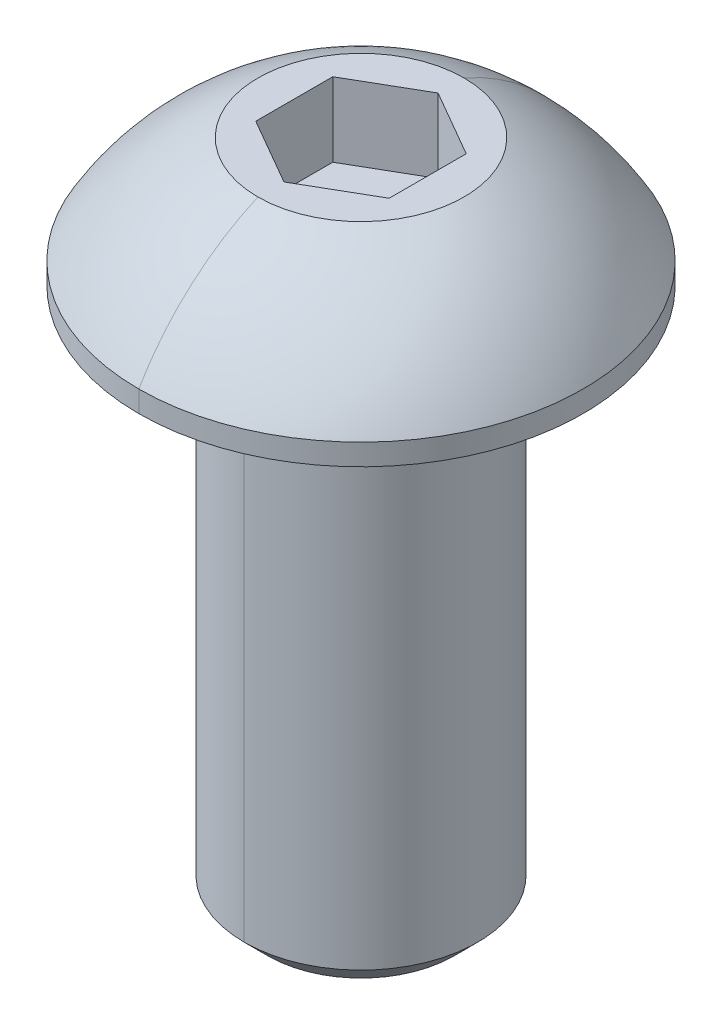
ISO-10303-21;
HEADER;
FILE_DESCRIPTION(('STEP AP214'),'2;1');
FILE_NAME('part.step','',(''),(''),'','','');
FILE_SCHEMA(('AUTOMOTIVE_DESIGN { 1 0 10303 214 1 1 1 1 }'));
ENDSEC;
DATA;
#1=APPLICATION_CONTEXT('core data for automotive mechanical design processes');
#2=APPLICATION_PROTOCOL_DEFINITION('international standard','automotive_design',2000,#1);
#3=PRODUCT_CONTEXT('',#1,'mechanical');
#4=PRODUCT('Part','Part','',(#3));
#5=PRODUCT_RELATED_PRODUCT_CATEGORY('part','',(#4));
#6=PRODUCT_DEFINITION_FORMATION('','',#4);
#7=PRODUCT_DEFINITION_CONTEXT('part definition',#1,'design');
#8=PRODUCT_DEFINITION('design','',#6,#7);
#9=PRODUCT_DEFINITION_SHAPE('','',#8);
#10=(LENGTH_UNIT() NAMED_UNIT(*) SI_UNIT(.MILLI.,.METRE.));
#11=(NAMED_UNIT(*) PLANE_ANGLE_UNIT() SI_UNIT($,.RADIAN.));
#12=(NAMED_UNIT(*) SI_UNIT($,.STERADIAN.) SOLID_ANGLE_UNIT());
#13=UNCERTAINTY_MEASURE_WITH_UNIT(LENGTH_MEASURE(1.E-05),#10,'distance_accuracy_value','');
#14=(GEOMETRIC_REPRESENTATION_CONTEXT(3) GLOBAL_UNCERTAINTY_ASSIGNED_CONTEXT((#13)) GLOBAL_UNIT_ASSIGNED_CONTEXT((#10,
#11,#12)) REPRESENTATION_CONTEXT('',''));
#15=CARTESIAN_POINT('',(0.,0.,0.));
#16=DIRECTION('',(0.,0.,1.));
#17=DIRECTION('',(1.,0.,0.));
#18=AXIS2_PLACEMENT_3D('',#15,#16,#17);
#19=CARTESIAN_POINT('',(0.,2.286,0.));
#20=DIRECTION('',(0.,-1.,0.));
#21=DIRECTION('',(0.,0.,-1.));
#22=AXIS2_PLACEMENT_3D('',#19,#20,#21);
#23=PLANE('',#22);
#24=CARTESIAN_POINT('',(0.,2.286,0.));
#25=DIRECTION('',(0.,-1.,0.));
#26=DIRECTION('',(0.,0.,-1.));
#27=AXIS2_PLACEMENT_3D('',#24,#25,#26);
#28=CIRCLE('',#27,1.83883254026);
#29=CARTESIAN_POINT('',(0.,2.286,-1.8388325408411));
#30=VERTEX_POINT('',#29);
#31=CARTESIAN_POINT('',(5.65750260079043E-13,2.28600000021423,1.83883254035411));
#32=VERTEX_POINT('',#31);
#33=EDGE_CURVE('E11',#30,#32,#28,.T.);
#34=ORIENTED_EDGE('',*,*,#33,.F.);
#35=CARTESIAN_POINT('',(0.,2.286,0.));
#36=DIRECTION('',(0.,-1.,0.));
#37=DIRECTION('',(0.,0.,-1.));
#38=AXIS2_PLACEMENT_3D('',#35,#36,#37);
#39=CIRCLE('',#38,1.83883254026);
#40=EDGE_CURVE('E25',#32,#30,#39,.T.);
#41=ORIENTED_EDGE('',*,*,#40,.F.);
#42=EDGE_LOOP('',(#34,#41));
#43=FACE_BOUND('',#42,.T.);
#44=DIRECTION('',(0.866025403784446,0.,-0.499999999999987));
#45=VECTOR('',#44,1.);
#46=CARTESIAN_POINT('',(0.,2.286,1.3740820936659));
#47=LINE('',#46,#45);
#48=CARTESIAN_POINT('',(0.,2.286,1.3740820936659));
#49=VERTEX_POINT('',#48);
#50=CARTESIAN_POINT('',(1.18999,2.286,0.687041046832961));
#51=VERTEX_POINT('',#50);
#52=EDGE_CURVE('E317',#49,#51,#47,.T.);
#53=ORIENTED_EDGE('',*,*,#52,.F.);
#54=DIRECTION('',(0.866025403784446,0.,0.499999999999987));
#55=VECTOR('',#54,1.);
#56=CARTESIAN_POINT('',(-1.18999,2.286,0.687041046832961));
#57=LINE('',#56,#55);
#58=CARTESIAN_POINT('',(-1.18999,2.286,0.687041046832961));
#59=VERTEX_POINT('',#58);
#60=EDGE_CURVE('E312',#59,#49,#57,.T.);
#61=ORIENTED_EDGE('',*,*,#60,.F.);
#62=DIRECTION('',(0.,0.,1.));
#63=VECTOR('',#62,1.);
#64=CARTESIAN_POINT('',(-1.18999,2.286,-0.687041046832961));
#65=LINE('',#64,#63);
#66=CARTESIAN_POINT('',(-1.18999,2.286,-0.687041046832961));
#67=VERTEX_POINT('',#66);
#68=EDGE_CURVE('E307',#67,#59,#65,.T.);
#69=ORIENTED_EDGE('',*,*,#68,.F.);
#70=DIRECTION('',(-0.866025403784446,0.,0.499999999999987));
#71=VECTOR('',#70,1.);
#72=CARTESIAN_POINT('',(0.,2.286,-1.3740820936659));
#73=LINE('',#72,#71);
#74=CARTESIAN_POINT('',(0.,2.286,-1.3740820936659));
#75=VERTEX_POINT('',#74);
#76=EDGE_CURVE('E302',#75,#67,#73,.T.);
#77=ORIENTED_EDGE('',*,*,#76,.F.);
#78=DIRECTION('',(-0.866025403784446,0.,-0.499999999999987));
#79=VECTOR('',#78,1.);
#80=CARTESIAN_POINT('',(1.18999,2.286,-0.687041046832961));
#81=LINE('',#80,#79);
#82=CARTESIAN_POINT('',(1.18999,2.286,-0.687041046832961));
#83=VERTEX_POINT('',#82);
#84=EDGE_CURVE('E297',#83,#75,#81,.T.);
#85=ORIENTED_EDGE('',*,*,#84,.F.);
#86=DIRECTION('',(0.,0.,1.));
#87=VECTOR('',#86,1.);
#88=CARTESIAN_POINT('',(1.18999,2.286,0.));
#89=LINE('',#88,#87);
#90=EDGE_CURVE('E293',#83,#51,#89,.T.);
#91=ORIENTED_EDGE('',*,*,#90,.T.);
#92=EDGE_LOOP('',(#53,#61,#69,#77,#85,#91));
#93=FACE_BOUND('',#92,.T.);
#94=ADVANCED_FACE('F17',(#43,#93),#23,.F.);
#95=CARTESIAN_POINT('',(1.18999,0.9652,0.687041046832961));
#96=DIRECTION('',(1.,0.,0.));
#97=DIRECTION('',(0.,0.,-1.));
#98=AXIS2_PLACEMENT_3D('',#95,#96,#97);
#99=PLANE('',#98);
#100=DIRECTION('',(0.,1.,0.));
#101=VECTOR('',#100,1.);
#102=CARTESIAN_POINT('',(1.18999,0.9652,0.687041046832961));
#103=LINE('',#102,#101);
#104=CARTESIAN_POINT('',(1.18999,0.9652,0.687041046832961));
#105=VERTEX_POINT('',#104);
#106=EDGE_CURVE('E288',#105,#51,#103,.T.);
#107=ORIENTED_EDGE('',*,*,#106,.T.);
#108=ORIENTED_EDGE('',*,*,#90,.F.);
#109=DIRECTION('',(0.,1.,0.));
#110=VECTOR('',#109,1.);
#111=CARTESIAN_POINT('',(1.18999,0.9652,-0.687041046832961));
#112=LINE('',#111,#110);
#113=CARTESIAN_POINT('',(1.18999,0.9652,-0.687041046832961));
#114=VERTEX_POINT('',#113);
#115=EDGE_CURVE('E283',#114,#83,#112,.T.);
#116=ORIENTED_EDGE('',*,*,#115,.F.);
#117=DIRECTION('',(0.,0.,-1.));
#118=VECTOR('',#117,1.);
#119=CARTESIAN_POINT('',(1.18999,0.9652,0.687041046832961));
#120=LINE('',#119,#118);
#121=EDGE_CURVE('E278',#105,#114,#120,.T.);
#122=ORIENTED_EDGE('',*,*,#121,.F.);
#123=EDGE_LOOP('',(#107,#108,#116,#122));
#124=FACE_BOUND('',#123,.T.);
#125=ADVANCED_FACE('F335',(#124),#99,.F.);
#126=CARTESIAN_POINT('',(0.,0.9652,0.));
#127=DIRECTION('',(0.,1.,0.));
#128=DIRECTION('',(0.,0.,1.));
#129=AXIS2_PLACEMENT_3D('',#126,#127,#128);
#130=PLANE('',#129);
#131=DIRECTION('',(0.,0.,1.));
#132=VECTOR('',#131,1.);
#133=CARTESIAN_POINT('',(-1.18999,0.9652,-0.687041046832961));
#134=LINE('',#133,#132);
#135=CARTESIAN_POINT('',(-1.18999,0.9652,-0.687041046832961));
#136=VERTEX_POINT('',#135);
#137=CARTESIAN_POINT('',(-1.18999,0.9652,0.687041046832961));
#138=VERTEX_POINT('',#137);
#139=EDGE_CURVE('E274',#136,#138,#134,.T.);
#140=ORIENTED_EDGE('',*,*,#139,.T.);
#141=DIRECTION('',(0.866025403784446,0.,0.499999999999987));
#142=VECTOR('',#141,1.);
#143=CARTESIAN_POINT('',(-1.18999,0.9652,0.687041046832961));
#144=LINE('',#143,#142);
#145=CARTESIAN_POINT('',(0.,0.9652,1.3740820936659));
#146=VERTEX_POINT('',#145);
#147=EDGE_CURVE('E270',#138,#146,#144,.T.);
#148=ORIENTED_EDGE('',*,*,#147,.T.);
#149=DIRECTION('',(0.866025403784446,0.,-0.499999999999987));
#150=VECTOR('',#149,1.);
#151=CARTESIAN_POINT('',(0.,0.9652,1.3740820936659));
#152=LINE('',#151,#150);
#153=EDGE_CURVE('E265',#146,#105,#152,.T.);
#154=ORIENTED_EDGE('',*,*,#153,.T.);
#155=ORIENTED_EDGE('',*,*,#121,.T.);
#156=DIRECTION('',(-0.866025403784446,0.,-0.499999999999987));
#157=VECTOR('',#156,1.);
#158=CARTESIAN_POINT('',(1.18999,0.9652,-0.687041046832961));
#159=LINE('',#158,#157);
#160=CARTESIAN_POINT('',(0.,0.9652,-1.3740820936659));
#161=VERTEX_POINT('',#160);
#162=EDGE_CURVE('E261',#114,#161,#159,.T.);
#163=ORIENTED_EDGE('',*,*,#162,.T.);
#164=DIRECTION('',(-0.866025403784446,0.,0.499999999999987));
#165=VECTOR('',#164,1.);
#166=CARTESIAN_POINT('',(0.,0.9652,-1.3740820936659));
#167=LINE('',#166,#165);
#168=EDGE_CURVE('E257',#161,#136,#167,.T.);
#169=ORIENTED_EDGE('',*,*,#168,.T.);
#170=EDGE_LOOP('',(#140,#148,#154,#155,#163,#169));
#171=FACE_BOUND('',#170,.T.);
#172=ADVANCED_FACE('F339',(#171),#130,.T.);
#173=CARTESIAN_POINT('',(0.,0.9652,-1.3740820936659));
#174=DIRECTION('',(-0.499999999999987,0.,-0.866025403784446));
#175=DIRECTION('',(-0.866025403784446,0.,0.499999999999987));
#176=AXIS2_PLACEMENT_3D('',#173,#174,#175);
#177=PLANE('',#176);
#178=ORIENTED_EDGE('',*,*,#76,.T.);
#179=DIRECTION('',(0.,1.,0.));
#180=VECTOR('',#179,1.);
#181=CARTESIAN_POINT('',(-1.18999,0.9652,-0.687041046832961));
#182=LINE('',#181,#180);
#183=EDGE_CURVE('E252',#136,#67,#182,.T.);
#184=ORIENTED_EDGE('',*,*,#183,.F.);
#185=ORIENTED_EDGE('',*,*,#168,.F.);
#186=DIRECTION('',(0.,1.,0.));
#187=VECTOR('',#186,1.);
#188=CARTESIAN_POINT('',(0.,0.9652,-1.3740820936659));
#189=LINE('',#188,#187);
#190=EDGE_CURVE('E247',#161,#75,#189,.T.);
#191=ORIENTED_EDGE('',*,*,#190,.T.);
#192=EDGE_LOOP('',(#178,#184,#185,#191));
#193=FACE_BOUND('',#192,.T.);
#194=ADVANCED_FACE('F357',(#193),#177,.F.);
#195=CARTESIAN_POINT('',(1.18999,0.9652,-0.687041046832961));
#196=DIRECTION('',(0.499999999999987,0.,-0.866025403784446));
#197=DIRECTION('',(-0.866025403784446,0.,-0.499999999999987));
#198=AXIS2_PLACEMENT_3D('',#195,#196,#197);
#199=PLANE('',#198);
#200=ORIENTED_EDGE('',*,*,#84,.T.);
#201=ORIENTED_EDGE('',*,*,#190,.F.);
#202=ORIENTED_EDGE('',*,*,#162,.F.);
#203=ORIENTED_EDGE('',*,*,#115,.T.);
#204=EDGE_LOOP('',(#200,#201,#202,#203));
#205=FACE_BOUND('',#204,.T.);
#206=ADVANCED_FACE('F360',(#205),#199,.F.);
#207=CARTESIAN_POINT('',(-1.18999,0.9652,-0.687041046832961));
#208=DIRECTION('',(-1.,0.,0.));
#209=DIRECTION('',(0.,0.,1.));
#210=AXIS2_PLACEMENT_3D('',#207,#208,#209);
#211=PLANE('',#210);
#212=ORIENTED_EDGE('',*,*,#68,.T.);
#213=DIRECTION('',(0.,1.,0.));
#214=VECTOR('',#213,1.);
#215=CARTESIAN_POINT('',(-1.18999,0.9652,0.687041046832961));
#216=LINE('',#215,#214);
#217=EDGE_CURVE('E242',#138,#59,#216,.T.);
#218=ORIENTED_EDGE('',*,*,#217,.F.);
#219=ORIENTED_EDGE('',*,*,#139,.F.);
#220=ORIENTED_EDGE('',*,*,#183,.T.);
#221=EDGE_LOOP('',(#212,#218,#219,#220));
#222=FACE_BOUND('',#221,.T.);
#223=ADVANCED_FACE('F355',(#222),#211,.F.);
#224=CARTESIAN_POINT('',(-1.18999,0.9652,0.687041046832961));
#225=DIRECTION('',(-0.499999999999987,0.,0.866025403784446));
#226=DIRECTION('',(0.866025403784446,0.,0.499999999999987));
#227=AXIS2_PLACEMENT_3D('',#224,#225,#226);
#228=PLANE('',#227);
#229=ORIENTED_EDGE('',*,*,#60,.T.);
#230=DIRECTION('',(0.,1.,0.));
#231=VECTOR('',#230,1.);
#232=CARTESIAN_POINT('',(0.,0.9652,1.3740820936659));
#233=LINE('',#232,#231);
#234=EDGE_CURVE('E239',#146,#49,#233,.T.);
#235=ORIENTED_EDGE('',*,*,#234,.F.);
#236=ORIENTED_EDGE('',*,*,#147,.F.);
#237=ORIENTED_EDGE('',*,*,#217,.T.);
#238=EDGE_LOOP('',(#229,#235,#236,#237));
#239=FACE_BOUND('',#238,.T.);
#240=ADVANCED_FACE('F332',(#239),#228,.F.);
#241=CARTESIAN_POINT('',(0.,0.9652,1.3740820936659));
#242=DIRECTION('',(0.499999999999987,0.,0.866025403784446));
#243=DIRECTION('',(0.866025403784446,0.,-0.499999999999987));
#244=AXIS2_PLACEMENT_3D('',#241,#242,#243);
#245=PLANE('',#244);
#246=ORIENTED_EDGE('',*,*,#52,.T.);
#247=ORIENTED_EDGE('',*,*,#106,.F.);
#248=ORIENTED_EDGE('',*,*,#153,.F.);
#249=ORIENTED_EDGE('',*,*,#234,.T.);
#250=EDGE_LOOP('',(#246,#247,#248,#249));
#251=FACE_BOUND('',#250,.T.);
#252=ADVANCED_FACE('F327',(#251),#245,.F.);
#253=CARTESIAN_POINT('',(2.81458883977238E-13,-1.89991434297709,0.));
#254=DIRECTION('',(0.,-1.,0.));
#255=DIRECTION('',(1.,0.,0.));
#256=AXIS2_PLACEMENT_3D('',#253,#254,#255);
#257=SPHERICAL_SURFACE('',#256,4.572);
#258=ORIENTED_EDGE('',*,*,#40,.T.);
#259=CARTESIAN_POINT('',(0.,2.28600000021423,-1.8388325403541));
#260=CARTESIAN_POINT('',(0.,2.26169089132892,-1.89417142434719));
#261=CARTESIAN_POINT('',(0.,2.23628320439049,-1.94902766261597));
#262=CARTESIAN_POINT('',(0.,2.18331330692768,-2.05768987502557));
#263=CARTESIAN_POINT('',(0.,2.1557510964033,-2.11149584916639));
#264=CARTESIAN_POINT('',(0.,2.09851478428885,-2.21797256064075));
#265=CARTESIAN_POINT('',(0.,2.06884068269879,-2.27064329797429));
#266=CARTESIAN_POINT('',(0.,2.00742745041631,-2.37476679120478));
#267=CARTESIAN_POINT('',(0.,1.97568831972391,-2.42621954710174));
#268=CARTESIAN_POINT('',(-1.14153738787547E-13,1.91019489569847,-2.52782612982118));
#269=CARTESIAN_POINT('',(-1.22002968106311E-13,1.87644060236544,-2.57797995664366));
#270=CARTESIAN_POINT('',(-1.374857964555E-13,1.80696995406679,-2.67690980825227));
#271=CARTESIAN_POINT('',(-1.45119395485924E-13,1.77125359910116,-2.72568583303841));
#272=CARTESIAN_POINT('',(-1.6015895719555E-13,1.69791499691647,-2.82178336603663));
#273=CARTESIAN_POINT('',(-1.67564919874753E-13,1.66029274969741,-2.86910487424872));
#274=CARTESIAN_POINT('',(-1.82137561195868E-13,1.58320153458104,-2.96221894946347));
#275=CARTESIAN_POINT('',(-1.89304239837781E-13,1.54373256668374,-3.00801151646614));
#276=CARTESIAN_POINT('',(-2.03387041624456E-13,1.46300998491769,-3.09799568858043));
#277=CARTESIAN_POINT('',(-2.10303164769219E-13,1.42175637104895,-3.14218729369204));
#278=CARTESIAN_POINT('',(-2.23873978239273E-13,1.33752937939282,-3.22890003974344));
#279=CARTESIAN_POINT('',(-2.30528668564564E-13,1.29455600160542,-3.27142118068323));
#280=CARTESIAN_POINT('',(-2.43566150051474E-13,1.20695706809849,-3.35472612211647));
#281=CARTESIAN_POINT('',(-2.49948941213093E-13,1.16233151237894,-3.39550992260993));
#282=CARTESIAN_POINT('',(-2.62432586350604E-13,1.07149841026382,-3.47527604370454));
#283=CARTESIAN_POINT('',(-2.68533440326495E-13,1.02529086386823,-3.5142583643057));
#284=CARTESIAN_POINT('',(-2.80443613914654E-13,0.9313664453798,-3.59036020300955));
#285=CARTESIAN_POINT('',(-2.86252933526922E-13,0.883649573286952,-3.62747972111225));
#286=CARTESIAN_POINT('',(-2.97570909326408E-13,0.786781580827452,-3.69979762331335));
#287=CARTESIAN_POINT('',(-3.03079565513626E-13,0.737630460460799,-3.73499600741175));
#288=CARTESIAN_POINT('',(-3.13787522427964E-13,0.637971160378178,-3.80341610254395));
#289=CARTESIAN_POINT('',(-3.18986823155084E-13,0.58746298066221,-3.83663781357774));
#290=CARTESIAN_POINT('',(-3.29067997424171E-13,0.485169423362047,-3.90105298708405));
#291=CARTESIAN_POINT('',(-3.33949870966139E-13,0.433384045777853,-3.93224644955657));
#292=CARTESIAN_POINT('',(-3.38668995053003E-13,0.38100000000009,-3.96240000000012));
#293=B_SPLINE_CURVE_WITH_KNOTS('',3,(#259,#260,#261,#262,#263,#264,#265,#266,#267,#268,#269,
#270,#271,#272,#273,#274,#275,#276,#277,#278,#279,#280,#281,#282,#283,#284,#285,#286,#287,#288,
#289,#290,#291,#292),.UNSPECIFIED.,.F.,.F.,(4,2,2,2,2,2,2,2,2,2,2,2,2,2,2,2,4),(0.,
0.181316258859248,0.362632517718496,0.543948776577745,0.725265035436994,0.906581294296242,
1.08789755315549,1.26921381201474,1.45053007087399,1.63184632973323,1.81316258859248,
1.99447884745173,2.17579510631098,2.35711136517023,2.53842762402948,2.71974388288872,
2.90106014174797),.UNSPECIFIED.);
#294=CARTESIAN_POINT('',(0.,0.38100000000001,-3.9624));
#295=VERTEX_POINT('',#294);
#296=EDGE_CURVE('E209',#30,#295,#293,.T.);
#297=ORIENTED_EDGE('',*,*,#296,.T.);
#298=CARTESIAN_POINT('',(0.,0.38100000000001,0.));
#299=DIRECTION('',(0.,-1.,0.));
#300=DIRECTION('',(0.,0.,-1.));
#301=AXIS2_PLACEMENT_3D('',#298,#299,#300);
#302=CIRCLE('',#301,3.9624);
#303=CARTESIAN_POINT('',(0.,0.381000000000011,3.9624));
#304=VERTEX_POINT('',#303);
#305=EDGE_CURVE('E225',#304,#295,#302,.T.);
#306=ORIENTED_EDGE('',*,*,#305,.F.);
#307=CARTESIAN_POINT('',(5.7191688398523E-13,2.28600000021423,1.8388325403541));
#308=CARTESIAN_POINT('',(5.80658093977564E-13,2.26169089132892,1.89417142434719));
#309=CARTESIAN_POINT('',(5.89323066454128E-13,2.23628320439049,1.94902766261597));
#310=CARTESIAN_POINT('',(6.06487113963421E-13,2.18331330692768,2.05768987502557));
#311=CARTESIAN_POINT('',(6.1498618899615E-13,2.1557510964033,2.11149584916639));
#312=CARTESIAN_POINT('',(6.31805019205476E-13,2.09851478428885,2.21797256064075));
#313=CARTESIAN_POINT('',(6.40124774382073E-13,2.06884068269879,2.27064329797428));
#314=CARTESIAN_POINT('',(6.56571896277741E-13,2.00742745041632,2.37476679120478));
#315=CARTESIAN_POINT('',(6.64699262996813E-13,1.97568831972391,2.42621954710174));
#316=CARTESIAN_POINT('',(6.80748815733095E-13,1.91019489569847,2.52782612982117));
#317=CARTESIAN_POINT('',(6.88671001750305E-13,1.87644060236544,2.57797995664365));
#318=CARTESIAN_POINT('',(7.04297756644127E-13,1.80696995406679,2.67690980825227));
#319=CARTESIAN_POINT('',(7.12002325520738E-13,1.77125359910116,2.72568583303841));
#320=CARTESIAN_POINT('',(7.27181645749342E-13,1.69791499691647,2.82178336603663));
#321=CARTESIAN_POINT('',(7.34656397101333E-13,1.66029274969741,2.86910487424871));
#322=CARTESIAN_POINT('',(7.49364635051545E-13,1.58320153458104,2.96221894946347));
#323=CARTESIAN_POINT('',(7.56598121649765E-13,1.54373256668374,3.00801151646614));
#324=CARTESIAN_POINT('',(7.70811301684429E-13,1.46300998491769,3.09799568858042));
#325=CARTESIAN_POINT('',(7.77790995120872E-13,1.42175637104896,3.14218729369204));
#326=CARTESIAN_POINT('',(7.91489910386942E-13,1.33752937939282,3.22890003974344));
#327=CARTESIAN_POINT('',(7.98209132216568E-13,1.29455600160543,3.27142118068323));
#328=CARTESIAN_POINT('',(8.11360492877076E-13,1.20695706809849,3.35472612211647));
#329=CARTESIAN_POINT('',(8.17792631707958E-13,1.16233151237895,3.39550992260993));
#330=CARTESIAN_POINT('',(8.30419586101306E-13,1.07149841026382,3.47527604370454));
#331=CARTESIAN_POINT('',(8.36614401663773E-13,1.02529086386824,3.5142583643057));
#332=CARTESIAN_POINT('',(8.48533506662625E-13,0.931366445379803,3.59036020300955));
#333=CARTESIAN_POINT('',(8.54257796099011E-13,0.883649573286955,3.62747972111225));
#334=CARTESIAN_POINT('',(8.66060809756616E-13,0.786781580827455,3.69979762331335));
#335=CARTESIAN_POINT('',(8.72139533977835E-13,0.737630460460802,3.73499600741175));
#336=CARTESIAN_POINT('',(8.81529461531119E-13,0.637971160378181,3.80341610254395));
#337=CARTESIAN_POINT('',(8.84840664863184E-13,0.587462980662213,3.83663781357774));
#338=CARTESIAN_POINT('',(8.93433510445934E-13,0.48516942336205,3.90105298708405));
#339=CARTESIAN_POINT('',(8.98715152696619E-13,0.433384045777856,3.93224644955657));
#340=CARTESIAN_POINT('',(9.07350994310502E-13,0.381000000000093,3.96240000000012));
#341=B_SPLINE_CURVE_WITH_KNOTS('',3,(#307,#308,#309,#310,#311,#312,#313,#314,#315,#316,#317,
#318,#319,#320,#321,#322,#323,#324,#325,#326,#327,#328,#329,#330,#331,#332,#333,#334,#335,#336,
#337,#338,#339,#340),.UNSPECIFIED.,.F.,.F.,(4,2,2,2,2,2,2,2,2,2,2,2,2,2,2,2,4),(0.,
0.181316258859248,0.362632517718497,0.543948776577745,0.725265035436993,0.906581294296241,
1.08789755315549,1.26921381201474,1.45053007087399,1.63184632973323,1.81316258859248,
1.99447884745173,2.17579510631098,2.35711136517023,2.53842762402948,2.71974388288872,
2.90106014174797),.UNSPECIFIED.);
#342=EDGE_CURVE('E212',#32,#304,#341,.T.);
#343=ORIENTED_EDGE('',*,*,#342,.F.);
#344=EDGE_LOOP('',(#258,#297,#306,#343));
#345=FACE_BOUND('',#344,.T.);
#346=ADVANCED_FACE('F192',(#345),#257,.T.);
#347=CARTESIAN_POINT('',(2.81458883977238E-13,-1.89991434297709,0.));
#348=DIRECTION('',(0.,-1.,0.));
#349=DIRECTION('',(-1.,0.,0.));
#350=AXIS2_PLACEMENT_3D('',#347,#348,#349);
#351=SPHERICAL_SURFACE('',#350,4.572);
#352=CARTESIAN_POINT('',(0.,0.38100000000001,0.));
#353=DIRECTION('',(0.,-1.,0.));
#354=DIRECTION('',(0.,0.,-1.));
#355=AXIS2_PLACEMENT_3D('',#352,#353,#354);
#356=CIRCLE('',#355,3.9624);
#357=EDGE_CURVE('E172',#295,#304,#356,.T.);
#358=ORIENTED_EDGE('',*,*,#357,.F.);
#359=ORIENTED_EDGE('',*,*,#296,.F.);
#360=ORIENTED_EDGE('',*,*,#33,.T.);
#361=ORIENTED_EDGE('',*,*,#342,.T.);
#362=EDGE_LOOP('',(#358,#359,#360,#361));
#363=FACE_BOUND('',#362,.T.);
#364=ADVANCED_FACE('F181',(#363),#351,.T.);
#365=CARTESIAN_POINT('',(0.,-9.525,0.));
#366=DIRECTION('',(0.,1.,0.));
#367=DIRECTION('',(-1.,0.,0.));
#368=AXIS2_PLACEMENT_3D('',#365,#366,#367);
#369=CYLINDRICAL_SURFACE('',#368,3.9624);
#370=CARTESIAN_POINT('',(0.,0.,0.));
#371=DIRECTION('',(0.,-1.,0.));
#372=DIRECTION('',(0.,0.,-1.));
#373=AXIS2_PLACEMENT_3D('',#370,#371,#372);
#374=CIRCLE('',#373,3.9624);
#375=CARTESIAN_POINT('',(0.,0.,-3.9624));
#376=VERTEX_POINT('',#375);
#377=CARTESIAN_POINT('',(0.,0.,3.9624));
#378=VERTEX_POINT('',#377);
#379=EDGE_CURVE('E167',#376,#378,#374,.T.);
#380=ORIENTED_EDGE('',*,*,#379,.F.);
#381=DIRECTION('',(0.,1.,0.));
#382=VECTOR('',#381,1.);
#383=CARTESIAN_POINT('',(0.,0.,-3.9624));
#384=LINE('',#383,#382);
#385=EDGE_CURVE('E162',#376,#295,#384,.T.);
#386=ORIENTED_EDGE('',*,*,#385,.T.);
#387=ORIENTED_EDGE('',*,*,#357,.T.);
#388=DIRECTION('',(0.,1.,0.));
#389=VECTOR('',#388,1.);
#390=CARTESIAN_POINT('',(0.,0.,3.9624));
#391=LINE('',#390,#389);
#392=EDGE_CURVE('E157',#378,#304,#391,.T.);
#393=ORIENTED_EDGE('',*,*,#392,.F.);
#394=EDGE_LOOP('',(#380,#386,#387,#393));
#395=FACE_BOUND('',#394,.T.);
#396=ADVANCED_FACE('F191',(#395),#369,.T.);
#397=CARTESIAN_POINT('',(0.,-9.525,0.));
#398=DIRECTION('',(0.,1.,0.));
#399=DIRECTION('',(1.,0.,0.));
#400=AXIS2_PLACEMENT_3D('',#397,#398,#399);
#401=CYLINDRICAL_SURFACE('',#400,3.9624);
#402=ORIENTED_EDGE('',*,*,#305,.T.);
#403=ORIENTED_EDGE('',*,*,#385,.F.);
#404=CARTESIAN_POINT('',(0.,0.,0.));
#405=DIRECTION('',(0.,-1.,0.));
#406=DIRECTION('',(0.,0.,-1.));
#407=AXIS2_PLACEMENT_3D('',#404,#405,#406);
#408=CIRCLE('',#407,3.9624);
#409=EDGE_CURVE('E152',#378,#376,#408,.T.);
#410=ORIENTED_EDGE('',*,*,#409,.F.);
#411=ORIENTED_EDGE('',*,*,#392,.T.);
#412=EDGE_LOOP('',(#402,#403,#410,#411));
#413=FACE_BOUND('',#412,.T.);
#414=ADVANCED_FACE('F426',(#413),#401,.T.);
#415=CARTESIAN_POINT('',(3.9624,0.,0.));
#416=DIRECTION('',(0.,1.,0.));
#417=DIRECTION('',(0.,0.,1.));
#418=AXIS2_PLACEMENT_3D('',#415,#416,#417);
#419=PLANE('',#418);
#420=CARTESIAN_POINT('',(0.,0.,0.));
#421=DIRECTION('',(0.,-1.,0.));
#422=DIRECTION('',(0.,0.,-1.));
#423=AXIS2_PLACEMENT_3D('',#420,#421,#422);
#424=CIRCLE('',#423,2.0828);
#425=CARTESIAN_POINT('',(0.,0.,-2.0828));
#426=VERTEX_POINT('',#425);
#427=CARTESIAN_POINT('',(0.,0.,2.0828));
#428=VERTEX_POINT('',#427);
#429=EDGE_CURVE('E147',#426,#428,#424,.T.);
#430=ORIENTED_EDGE('',*,*,#429,.F.);
#431=CARTESIAN_POINT('',(0.,0.,0.));
#432=DIRECTION('',(0.,-1.,0.));
#433=DIRECTION('',(0.,0.,-1.));
#434=AXIS2_PLACEMENT_3D('',#431,#432,#433);
#435=CIRCLE('',#434,2.0828);
#436=EDGE_CURVE('E142',#428,#426,#435,.T.);
#437=ORIENTED_EDGE('',*,*,#436,.F.);
#438=EDGE_LOOP('',(#430,#437));
#439=FACE_BOUND('',#438,.T.);
#440=ORIENTED_EDGE('',*,*,#379,.T.);
#441=ORIENTED_EDGE('',*,*,#409,.T.);
#442=EDGE_LOOP('',(#440,#441));
#443=FACE_BOUND('',#442,.T.);
#444=ADVANCED_FACE('F435',(#439,#443),#419,.F.);
#445=CARTESIAN_POINT('',(0.,-9.525,0.));
#446=DIRECTION('',(0.,1.,0.));
#447=DIRECTION('',(1.,0.,0.));
#448=AXIS2_PLACEMENT_3D('',#445,#446,#447);
#449=CYLINDRICAL_SURFACE('',#448,2.0828);
#450=ORIENTED_EDGE('',*,*,#436,.T.);
#451=DIRECTION('',(0.,1.,0.));
#452=VECTOR('',#451,1.);
#453=CARTESIAN_POINT('',(0.,-9.10463,-2.0828));
#454=LINE('',#453,#452);
#455=CARTESIAN_POINT('',(0.,-9.10463,-2.0828));
#456=VERTEX_POINT('',#455);
#457=EDGE_CURVE('E137',#456,#426,#454,.T.);
#458=ORIENTED_EDGE('',*,*,#457,.F.);
#459=CARTESIAN_POINT('',(0.,-9.10463,0.));
#460=DIRECTION('',(0.,-1.,0.));
#461=DIRECTION('',(0.,0.,-1.));
#462=AXIS2_PLACEMENT_3D('',#459,#460,#461);
#463=CIRCLE('',#462,2.0828);
#464=CARTESIAN_POINT('',(0.,-9.10463,2.0828));
#465=VERTEX_POINT('',#464);
#466=EDGE_CURVE('E133',#465,#456,#463,.T.);
#467=ORIENTED_EDGE('',*,*,#466,.F.);
#468=DIRECTION('',(0.,1.,0.));
#469=VECTOR('',#468,1.);
#470=CARTESIAN_POINT('',(0.,-9.10463,2.0828));
#471=LINE('',#470,#469);
#472=EDGE_CURVE('E121',#465,#428,#471,.T.);
#473=ORIENTED_EDGE('',*,*,#472,.T.);
#474=EDGE_LOOP('',(#450,#458,#467,#473));
#475=FACE_BOUND('',#474,.T.);
#476=ADVANCED_FACE('F444',(#475),#449,.T.);
#477=CARTESIAN_POINT('',(0.,-9.525,0.));
#478=DIRECTION('',(0.,1.,0.));
#479=DIRECTION('',(-1.,0.,0.));
#480=AXIS2_PLACEMENT_3D('',#477,#478,#479);
#481=CYLINDRICAL_SURFACE('',#480,2.0828);
#482=CARTESIAN_POINT('',(0.,-9.10463,0.));
#483=DIRECTION('',(0.,-1.,0.));
#484=DIRECTION('',(0.,0.,-1.));
#485=AXIS2_PLACEMENT_3D('',#482,#483,#484);
#486=CIRCLE('',#485,2.0828);
#487=EDGE_CURVE('E109',#456,#465,#486,.T.);
#488=ORIENTED_EDGE('',*,*,#487,.F.);
#489=ORIENTED_EDGE('',*,*,#457,.T.);
#490=ORIENTED_EDGE('',*,*,#429,.T.);
#491=ORIENTED_EDGE('',*,*,#472,.F.);
#492=EDGE_LOOP('',(#488,#489,#490,#491));
#493=FACE_BOUND('',#492,.T.);
#494=ADVANCED_FACE('F454',(#493),#481,.T.);
#495=CARTESIAN_POINT('',(0.,-9.10463,0.));
#496=DIRECTION('',(0.,1.,0.));
#497=DIRECTION('',(-1.,0.,0.));
#498=AXIS2_PLACEMENT_3D('',#495,#496,#497);
#499=CONICAL_SURFACE('',#498,2.0828,0.7853981634);
#500=CARTESIAN_POINT('',(0.,-9.525,0.));
#501=DIRECTION('',(0.,-1.,0.));
#502=DIRECTION('',(0.,0.,-1.));
#503=AXIS2_PLACEMENT_3D('',#500,#501,#502);
#504=CIRCLE('',#503,1.66243);
#505=CARTESIAN_POINT('',(0.,-9.525,-1.66243));
#506=VERTEX_POINT('',#505);
#507=CARTESIAN_POINT('',(0.,-9.52499999999893,1.66242999999893));
#508=VERTEX_POINT('',#507);
#509=EDGE_CURVE('E106',#506,#508,#504,.T.);
#510=ORIENTED_EDGE('',*,*,#509,.F.);
#511=DIRECTION('',(0.,0.707106781184742,-0.707106781188353));
#512=VECTOR('',#511,1.);
#513=CARTESIAN_POINT('',(0.,-9.52499999999892,-1.66242999999893));
#514=LINE('',#513,#512);
#515=EDGE_CURVE('E112',#506,#456,#514,.T.);
#516=ORIENTED_EDGE('',*,*,#515,.T.);
#517=ORIENTED_EDGE('',*,*,#487,.T.);
#518=DIRECTION('',(0.,0.707106781184741,0.707106781188354));
#519=VECTOR('',#518,1.);
#520=CARTESIAN_POINT('',(0.,-9.52499999999892,1.66242999999893));
#521=LINE('',#520,#519);
#522=EDGE_CURVE('E101',#508,#465,#521,.T.);
#523=ORIENTED_EDGE('',*,*,#522,.F.);
#524=EDGE_LOOP('',(#510,#516,#517,#523));
#525=FACE_BOUND('',#524,.T.);
#526=ADVANCED_FACE('F103',(#525),#499,.T.);
#527=CARTESIAN_POINT('',(0.,-9.10463,0.));
#528=DIRECTION('',(0.,1.,0.));
#529=DIRECTION('',(1.,0.,0.));
#530=AXIS2_PLACEMENT_3D('',#527,#528,#529);
#531=CONICAL_SURFACE('',#530,2.0828,0.7853981634);
#532=ORIENTED_EDGE('',*,*,#466,.T.);
#533=ORIENTED_EDGE('',*,*,#515,.F.);
#534=CARTESIAN_POINT('',(0.,-9.525,0.));
#535=DIRECTION('',(0.,-1.,0.));
#536=DIRECTION('',(0.,0.,-1.));
#537=AXIS2_PLACEMENT_3D('',#534,#535,#536);
#538=CIRCLE('',#537,1.66243);
#539=EDGE_CURVE('E113',#508,#506,#538,.T.);
#540=ORIENTED_EDGE('',*,*,#539,.F.);
#541=ORIENTED_EDGE('',*,*,#522,.T.);
#542=EDGE_LOOP('',(#532,#533,#540,#541));
#543=FACE_BOUND('',#542,.T.);
#544=ADVANCED_FACE('F116',(#543),#531,.T.);
#545=CARTESIAN_POINT('',(1.66243,-9.525,0.));
#546=DIRECTION('',(0.,1.,0.));
#547=DIRECTION('',(0.,0.,1.));
#548=AXIS2_PLACEMENT_3D('',#545,#546,#547);
#549=PLANE('',#548);
#550=ORIENTED_EDGE('',*,*,#509,.T.);
#551=ORIENTED_EDGE('',*,*,#539,.T.);
#552=EDGE_LOOP('',(#550,#551));
#553=FACE_BOUND('',#552,.T.);
#554=ADVANCED_FACE('F119',(#553),#549,.F.);
#555=CLOSED_SHELL('',(#94,#125,#172,#194,#206,#223,#240,#252,#346,#364,#396,#414,#444,#476,#494,
#526,#544,#554));
#556=MANIFOLD_SOLID_BREP('B1',#555);
#557=ADVANCED_BREP_SHAPE_REPRESENTATION('',(#18,#556),#14);
#558=SHAPE_DEFINITION_REPRESENTATION(#9,#557);
ENDSEC;
END-ISO-10303-21;
